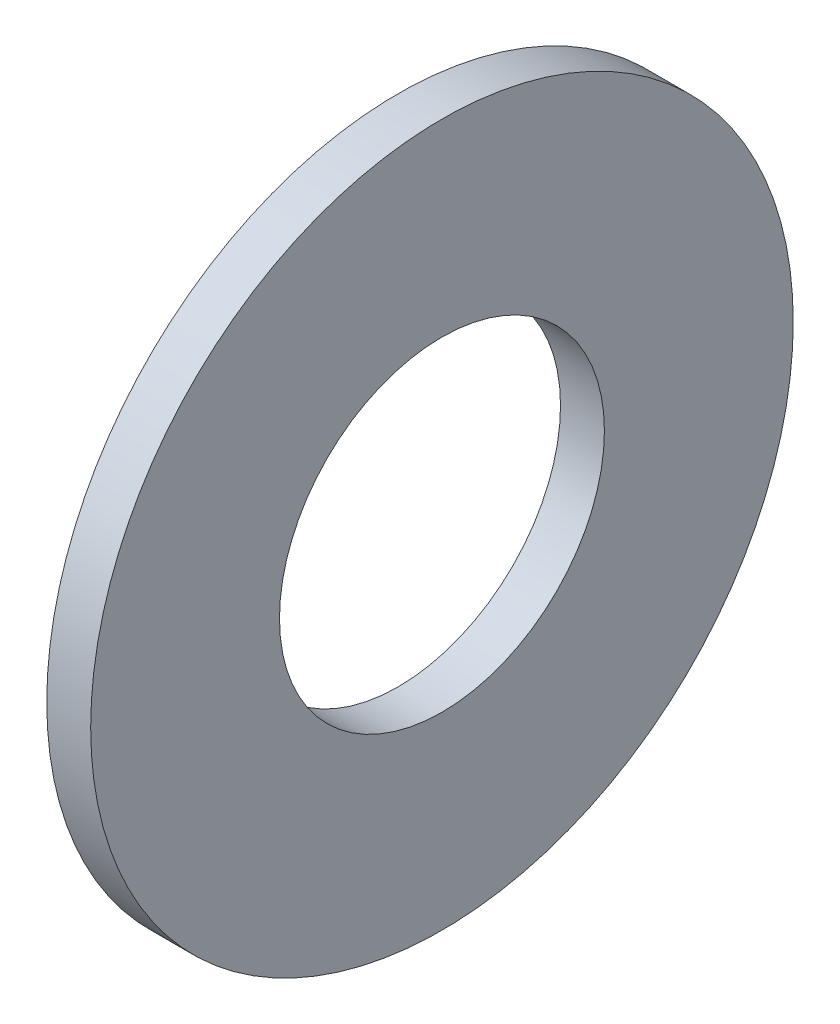
ISO-10303-21;
HEADER;
FILE_DESCRIPTION(('STEP AP214'),'2;1');
FILE_NAME('part.step','',(''),(''),'','','');
FILE_SCHEMA(('AUTOMOTIVE_DESIGN { 1 0 10303 214 1 1 1 1 }'));
ENDSEC;
DATA;
#1=APPLICATION_CONTEXT('core data for automotive mechanical design processes');
#2=APPLICATION_PROTOCOL_DEFINITION('international standard','automotive_design',2000,#1);
#3=PRODUCT_CONTEXT('',#1,'mechanical');
#4=PRODUCT('Part','Part','',(#3));
#5=PRODUCT_RELATED_PRODUCT_CATEGORY('part','',(#4));
#6=PRODUCT_DEFINITION_FORMATION('','',#4);
#7=PRODUCT_DEFINITION_CONTEXT('part definition',#1,'design');
#8=PRODUCT_DEFINITION('design','',#6,#7);
#9=PRODUCT_DEFINITION_SHAPE('','',#8);
#10=(LENGTH_UNIT() NAMED_UNIT(*) SI_UNIT(.MILLI.,.METRE.));
#11=(NAMED_UNIT(*) PLANE_ANGLE_UNIT() SI_UNIT($,.RADIAN.));
#12=(NAMED_UNIT(*) SI_UNIT($,.STERADIAN.) SOLID_ANGLE_UNIT());
#13=UNCERTAINTY_MEASURE_WITH_UNIT(LENGTH_MEASURE(1.E-05),#10,'distance_accuracy_value','');
#14=(GEOMETRIC_REPRESENTATION_CONTEXT(3) GLOBAL_UNCERTAINTY_ASSIGNED_CONTEXT((#13)) GLOBAL_UNIT_ASSIGNED_CONTEXT((#10,
#11,#12)) REPRESENTATION_CONTEXT('',''));
#15=CARTESIAN_POINT('',(0.,0.,0.));
#16=DIRECTION('',(0.,0.,1.));
#17=DIRECTION('',(1.,0.,0.));
#18=AXIS2_PLACEMENT_3D('',#15,#16,#17);
#19=CARTESIAN_POINT('',(-0.5,4.,0.));
#20=DIRECTION('',(1.,0.,0.));
#21=DIRECTION('',(0.,0.,-1.));
#22=AXIS2_PLACEMENT_3D('',#19,#20,#21);
#23=PLANE('',#22);
#24=CARTESIAN_POINT('',(-0.5,0.,0.));
#25=DIRECTION('',(-1.,0.,0.));
#26=DIRECTION('',(0.,0.,1.));
#27=AXIS2_PLACEMENT_3D('',#24,#25,#26);
#28=CIRCLE('',#27,4.);
#29=CARTESIAN_POINT('',(-0.5,0.,4.));
#30=VERTEX_POINT('',#29);
#31=EDGE_CURVE('E17',#30,#30,#28,.F.);
#32=ORIENTED_EDGE('',*,*,#31,.F.);
#33=EDGE_LOOP('',(#32));
#34=FACE_BOUND('',#33,.T.);
#35=CARTESIAN_POINT('',(-0.5,0.,0.));
#36=DIRECTION('',(-1.,0.,0.));
#37=DIRECTION('',(0.,0.,1.));
#38=AXIS2_PLACEMENT_3D('',#35,#36,#37);
#39=CIRCLE('',#38,1.85);
#40=CARTESIAN_POINT('',(-0.5,0.,1.85));
#41=VERTEX_POINT('',#40);
#42=EDGE_CURVE('E30',#41,#41,#39,.F.);
#43=ORIENTED_EDGE('',*,*,#42,.T.);
#44=EDGE_LOOP('',(#43));
#45=FACE_BOUND('',#44,.T.);
#46=ADVANCED_FACE('F14',(#34,#45),#23,.F.);
#47=CARTESIAN_POINT('',(-34.9249999999999,0.,0.));
#48=DIRECTION('',(-1.,0.,0.));
#49=DIRECTION('',(0.,0.,1.));
#50=AXIS2_PLACEMENT_3D('',#47,#48,#49);
#51=CYLINDRICAL_SURFACE('',#50,4.);
#52=ORIENTED_EDGE('',*,*,#31,.T.);
#53=EDGE_LOOP('',(#52));
#54=FACE_BOUND('',#53,.T.);
#55=CARTESIAN_POINT('',(0.,0.,0.));
#56=DIRECTION('',(-1.,0.,0.));
#57=DIRECTION('',(0.,0.,1.));
#58=AXIS2_PLACEMENT_3D('',#55,#56,#57);
#59=CIRCLE('',#58,4.);
#60=CARTESIAN_POINT('',(0.,0.,4.));
#61=VERTEX_POINT('',#60);
#62=EDGE_CURVE('E22',#61,#61,#59,.T.);
#63=ORIENTED_EDGE('',*,*,#62,.T.);
#64=EDGE_LOOP('',(#63));
#65=FACE_BOUND('',#64,.T.);
#66=ADVANCED_FACE('F42',(#54,#65),#51,.T.);
#67=CARTESIAN_POINT('',(-34.9249999999999,0.,0.));
#68=DIRECTION('',(-1.,0.,0.));
#69=DIRECTION('',(0.,0.,1.));
#70=AXIS2_PLACEMENT_3D('',#67,#68,#69);
#71=CYLINDRICAL_SURFACE('',#70,1.85);
#72=CARTESIAN_POINT('',(0.,0.,0.));
#73=DIRECTION('',(-1.,0.,0.));
#74=DIRECTION('',(0.,0.,1.));
#75=AXIS2_PLACEMENT_3D('',#72,#73,#74);
#76=CIRCLE('',#75,1.85);
#77=CARTESIAN_POINT('',(0.,0.,1.85));
#78=VERTEX_POINT('',#77);
#79=EDGE_CURVE('E10',#78,#78,#76,.F.);
#80=ORIENTED_EDGE('',*,*,#79,.T.);
#81=EDGE_LOOP('',(#80));
#82=FACE_BOUND('',#81,.T.);
#83=ORIENTED_EDGE('',*,*,#42,.F.);
#84=EDGE_LOOP('',(#83));
#85=FACE_BOUND('',#84,.T.);
#86=ADVANCED_FACE('F50',(#82,#85),#71,.F.);
#87=CARTESIAN_POINT('',(0.,1.85,0.));
#88=DIRECTION('',(-1.,0.,0.));
#89=DIRECTION('',(0.,0.,1.));
#90=AXIS2_PLACEMENT_3D('',#87,#88,#89);
#91=PLANE('',#90);
#92=ORIENTED_EDGE('',*,*,#79,.F.);
#93=EDGE_LOOP('',(#92));
#94=FACE_BOUND('',#93,.T.);
#95=ORIENTED_EDGE('',*,*,#62,.F.);
#96=EDGE_LOOP('',(#95));
#97=FACE_BOUND('',#96,.T.);
#98=ADVANCED_FACE('F51',(#94,#97),#91,.F.);
#99=CLOSED_SHELL('',(#46,#66,#86,#98));
#100=MANIFOLD_SOLID_BREP('B1',#99);
#101=ADVANCED_BREP_SHAPE_REPRESENTATION('',(#18,#100),#14);
#102=SHAPE_DEFINITION_REPRESENTATION(#9,#101);
ENDSEC;
END-ISO-10303-21;
